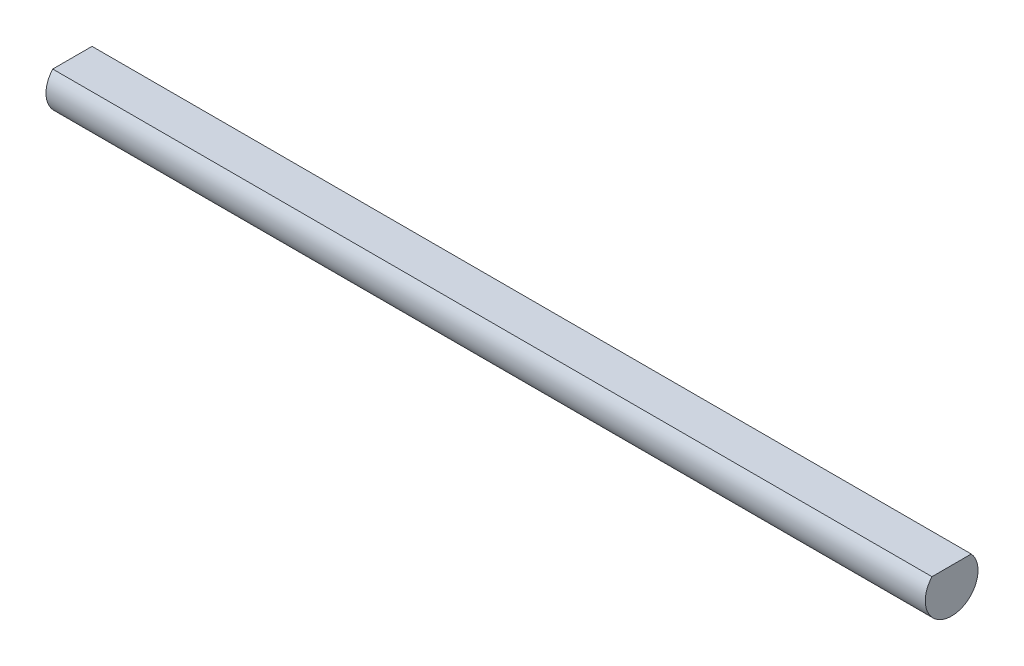
ISO-10303-21;
HEADER;
FILE_DESCRIPTION(('STEP AP214'),'2;1');
FILE_NAME('part.step','',(''),(''),'','','');
FILE_SCHEMA(('AUTOMOTIVE_DESIGN { 1 0 10303 214 1 1 1 1 }'));
ENDSEC;
DATA;
#1=APPLICATION_CONTEXT('core data for automotive mechanical design processes');
#2=APPLICATION_PROTOCOL_DEFINITION('international standard','automotive_design',2000,#1);
#3=PRODUCT_CONTEXT('',#1,'mechanical');
#4=PRODUCT('Part','Part','',(#3));
#5=PRODUCT_RELATED_PRODUCT_CATEGORY('part','',(#4));
#6=PRODUCT_DEFINITION_FORMATION('','',#4);
#7=PRODUCT_DEFINITION_CONTEXT('part definition',#1,'design');
#8=PRODUCT_DEFINITION('design','',#6,#7);
#9=PRODUCT_DEFINITION_SHAPE('','',#8);
#10=(LENGTH_UNIT() NAMED_UNIT(*) SI_UNIT(.MILLI.,.METRE.));
#11=(NAMED_UNIT(*) PLANE_ANGLE_UNIT() SI_UNIT($,.RADIAN.));
#12=(NAMED_UNIT(*) SI_UNIT($,.STERADIAN.) SOLID_ANGLE_UNIT());
#13=UNCERTAINTY_MEASURE_WITH_UNIT(LENGTH_MEASURE(1.E-05),#10,'distance_accuracy_value','');
#14=(GEOMETRIC_REPRESENTATION_CONTEXT(3) GLOBAL_UNCERTAINTY_ASSIGNED_CONTEXT((#13)) GLOBAL_UNIT_ASSIGNED_CONTEXT((#10,
#11,#12)) REPRESENTATION_CONTEXT('',''));
#15=CARTESIAN_POINT('',(0.,0.,0.));
#16=DIRECTION('',(0.,0.,1.));
#17=DIRECTION('',(1.,0.,0.));
#18=AXIS2_PLACEMENT_3D('',#15,#16,#17);
#19=CARTESIAN_POINT('',(50.,0.,0.));
#20=DIRECTION('',(-1.,0.,0.));
#21=DIRECTION('',(0.,0.,1.));
#22=AXIS2_PLACEMENT_3D('',#19,#20,#21);
#23=CYLINDRICAL_SURFACE('',#22,3.);
#24=CARTESIAN_POINT('',(-50.,0.,0.));
#25=DIRECTION('',(1.,0.,0.));
#26=DIRECTION('',(0.,0.,-1.));
#27=AXIS2_PLACEMENT_3D('',#24,#25,#26);
#28=CIRCLE('',#27,3.);
#29=CARTESIAN_POINT('',(-50.,2.,2.23606797749979));
#30=VERTEX_POINT('',#29);
#31=CARTESIAN_POINT('',(-50.,2.,-2.23606797749979));
#32=VERTEX_POINT('',#31);
#33=EDGE_CURVE('E78',#30,#32,#28,.T.);
#34=ORIENTED_EDGE('',*,*,#33,.T.);
#35=DIRECTION('',(-1.,0.,0.));
#36=VECTOR('',#35,1.);
#37=CARTESIAN_POINT('',(50.,2.,-2.23606797749979));
#38=LINE('',#37,#36);
#39=CARTESIAN_POINT('',(50.,2.,-2.23606797749979));
#40=VERTEX_POINT('',#39);
#41=EDGE_CURVE('E11',#40,#32,#38,.T.);
#42=ORIENTED_EDGE('',*,*,#41,.F.);
#43=CARTESIAN_POINT('',(50.,0.,0.));
#44=DIRECTION('',(1.,0.,0.));
#45=DIRECTION('',(0.,0.,-1.));
#46=AXIS2_PLACEMENT_3D('',#43,#44,#45);
#47=CIRCLE('',#46,3.);
#48=CARTESIAN_POINT('',(50.,2.,2.23606797749979));
#49=VERTEX_POINT('',#48);
#50=EDGE_CURVE('E77',#49,#40,#47,.T.);
#51=ORIENTED_EDGE('',*,*,#50,.F.);
#52=DIRECTION('',(-1.,0.,0.));
#53=VECTOR('',#52,1.);
#54=CARTESIAN_POINT('',(50.,2.,2.23606797749979));
#55=LINE('',#54,#53);
#56=EDGE_CURVE('E54',#49,#30,#55,.T.);
#57=ORIENTED_EDGE('',*,*,#56,.T.);
#58=EDGE_LOOP('',(#34,#42,#51,#57));
#59=FACE_BOUND('',#58,.T.);
#60=ADVANCED_FACE('F45',(#59),#23,.T.);
#61=CARTESIAN_POINT('',(50.,2.,2.23606797749979));
#62=DIRECTION('',(0.,-1.,0.));
#63=DIRECTION('',(0.,0.,-1.));
#64=AXIS2_PLACEMENT_3D('',#61,#62,#63);
#65=PLANE('',#64);
#66=DIRECTION('',(0.,0.,1.));
#67=VECTOR('',#66,1.);
#68=CARTESIAN_POINT('',(-50.,2.,2.23606797749979));
#69=LINE('',#68,#67);
#70=EDGE_CURVE('E69',#32,#30,#69,.T.);
#71=ORIENTED_EDGE('',*,*,#70,.T.);
#72=ORIENTED_EDGE('',*,*,#56,.F.);
#73=DIRECTION('',(0.,0.,1.));
#74=VECTOR('',#73,1.);
#75=CARTESIAN_POINT('',(50.,2.,2.23606797749979));
#76=LINE('',#75,#74);
#77=EDGE_CURVE('E61',#40,#49,#76,.T.);
#78=ORIENTED_EDGE('',*,*,#77,.F.);
#79=ORIENTED_EDGE('',*,*,#41,.T.);
#80=EDGE_LOOP('',(#71,#72,#78,#79));
#81=FACE_BOUND('',#80,.T.);
#82=ADVANCED_FACE('F72',(#81),#65,.F.);
#83=CARTESIAN_POINT('',(50.,0.,0.));
#84=DIRECTION('',(1.,0.,0.));
#85=DIRECTION('',(0.,0.,-1.));
#86=AXIS2_PLACEMENT_3D('',#83,#84,#85);
#87=PLANE('',#86);
#88=ORIENTED_EDGE('',*,*,#50,.T.);
#89=ORIENTED_EDGE('',*,*,#77,.T.);
#90=EDGE_LOOP('',(#88,#89));
#91=FACE_BOUND('',#90,.T.);
#92=ADVANCED_FACE('F89',(#91),#87,.T.);
#93=CARTESIAN_POINT('',(-50.,0.,0.));
#94=DIRECTION('',(1.,0.,0.));
#95=DIRECTION('',(0.,0.,-1.));
#96=AXIS2_PLACEMENT_3D('',#93,#94,#95);
#97=PLANE('',#96);
#98=ORIENTED_EDGE('',*,*,#33,.F.);
#99=ORIENTED_EDGE('',*,*,#70,.F.);
#100=EDGE_LOOP('',(#98,#99));
#101=FACE_BOUND('',#100,.T.);
#102=ADVANCED_FACE('F82',(#101),#97,.F.);
#103=CLOSED_SHELL('',(#60,#82,#92,#102));
#104=MANIFOLD_SOLID_BREP('B2',#103);
#105=ADVANCED_BREP_SHAPE_REPRESENTATION('',(#18,#104),#14);
#106=SHAPE_DEFINITION_REPRESENTATION(#9,#105);
ENDSEC;
END-ISO-10303-21;
